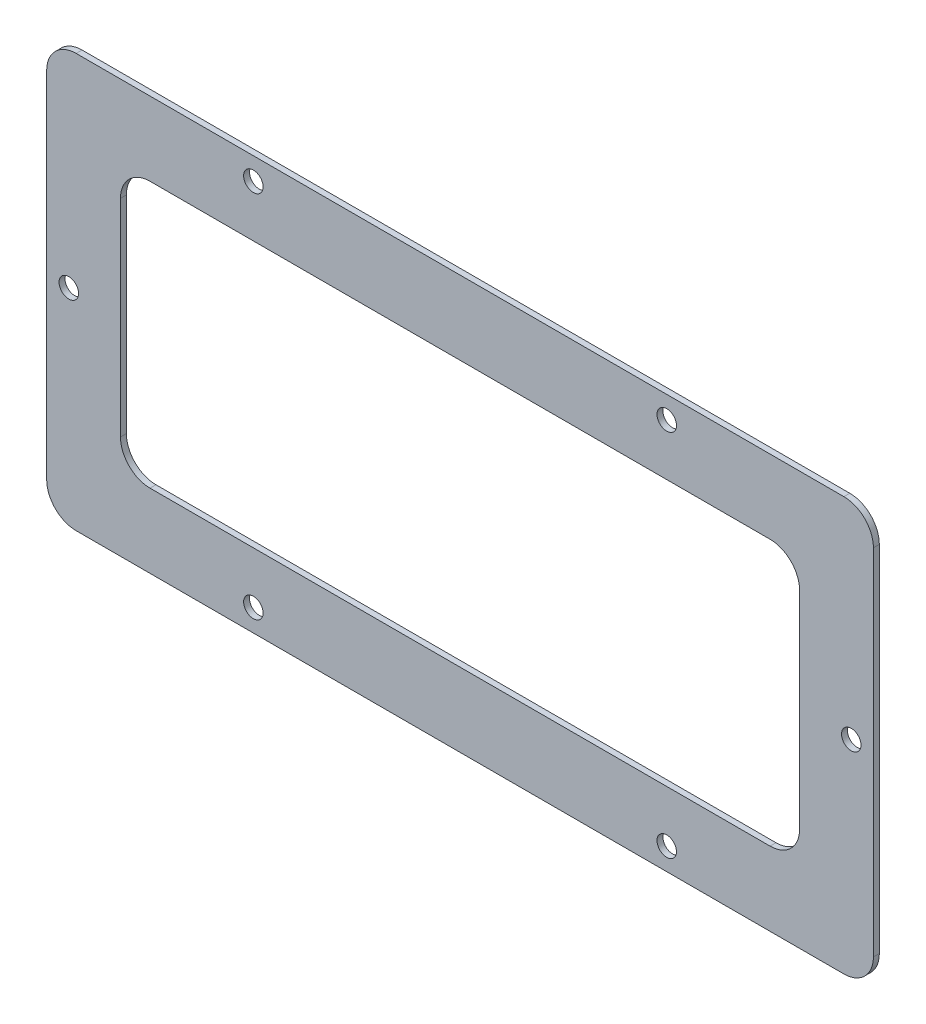
ISO-10303-21;
HEADER;
FILE_DESCRIPTION(('STEP AP214'),'2;1');
FILE_NAME('part.step','',(''),(''),'','','');
FILE_SCHEMA(('AUTOMOTIVE_DESIGN { 1 0 10303 214 1 1 1 1 }'));
ENDSEC;
DATA;
#1=APPLICATION_CONTEXT('core data for automotive mechanical design processes');
#2=APPLICATION_PROTOCOL_DEFINITION('international standard','automotive_design',2000,#1);
#3=PRODUCT_CONTEXT('',#1,'mechanical');
#4=PRODUCT('Part','Part','',(#3));
#5=PRODUCT_RELATED_PRODUCT_CATEGORY('part','',(#4));
#6=PRODUCT_DEFINITION_FORMATION('','',#4);
#7=PRODUCT_DEFINITION_CONTEXT('part definition',#1,'design');
#8=PRODUCT_DEFINITION('design','',#6,#7);
#9=PRODUCT_DEFINITION_SHAPE('','',#8);
#10=(LENGTH_UNIT() NAMED_UNIT(*) SI_UNIT(.MILLI.,.METRE.));
#11=(NAMED_UNIT(*) PLANE_ANGLE_UNIT() SI_UNIT($,.RADIAN.));
#12=(NAMED_UNIT(*) SI_UNIT($,.STERADIAN.) SOLID_ANGLE_UNIT());
#13=UNCERTAINTY_MEASURE_WITH_UNIT(LENGTH_MEASURE(1.E-05),#10,'distance_accuracy_value','');
#14=(GEOMETRIC_REPRESENTATION_CONTEXT(3) GLOBAL_UNCERTAINTY_ASSIGNED_CONTEXT((#13)) GLOBAL_UNIT_ASSIGNED_CONTEXT((#10,
#11,#12)) REPRESENTATION_CONTEXT('',''));
#15=CARTESIAN_POINT('',(0.,0.,0.));
#16=DIRECTION('',(0.,0.,1.));
#17=DIRECTION('',(1.,0.,0.));
#18=AXIS2_PLACEMENT_3D('',#15,#16,#17);
#19=CARTESIAN_POINT('',(140.,-70.,0.));
#20=DIRECTION('',(0.,-1.,0.));
#21=DIRECTION('',(1.,0.,0.));
#22=AXIS2_PLACEMENT_3D('',#19,#20,#21);
#23=PLANE('',#22);
#24=DIRECTION('',(0.,0.,1.));
#25=VECTOR('',#24,1.);
#26=CARTESIAN_POINT('',(-130.,-70.,0.));
#27=LINE('',#26,#25);
#28=CARTESIAN_POINT('',(-130.,-70.,-2.));
#29=VERTEX_POINT('',#28);
#30=CARTESIAN_POINT('',(-130.,-70.,0.));
#31=VERTEX_POINT('',#30);
#32=EDGE_CURVE('E11',#29,#31,#27,.T.);
#33=ORIENTED_EDGE('',*,*,#32,.F.);
#34=DIRECTION('',(1.,0.,0.));
#35=VECTOR('',#34,1.);
#36=CARTESIAN_POINT('',(0.,-70.,-2.));
#37=LINE('',#36,#35);
#38=CARTESIAN_POINT('',(130.,-70.,-2.));
#39=VERTEX_POINT('',#38);
#40=EDGE_CURVE('E129',#29,#39,#37,.T.);
#41=ORIENTED_EDGE('',*,*,#40,.T.);
#42=DIRECTION('',(0.,0.,1.));
#43=VECTOR('',#42,1.);
#44=CARTESIAN_POINT('',(130.,-70.,0.));
#45=LINE('',#44,#43);
#46=CARTESIAN_POINT('',(130.,-70.,0.));
#47=VERTEX_POINT('',#46);
#48=EDGE_CURVE('E47',#39,#47,#45,.T.);
#49=ORIENTED_EDGE('',*,*,#48,.T.);
#50=DIRECTION('',(1.,0.,0.));
#51=VECTOR('',#50,1.);
#52=CARTESIAN_POINT('',(140.,-70.,0.));
#53=LINE('',#52,#51);
#54=EDGE_CURVE('E197',#31,#47,#53,.T.);
#55=ORIENTED_EDGE('',*,*,#54,.F.);
#56=EDGE_LOOP('',(#33,#41,#49,#55));
#57=FACE_BOUND('',#56,.T.);
#58=ADVANCED_FACE('F37',(#57),#23,.T.);
#59=CARTESIAN_POINT('',(130.,-60.,0.));
#60=DIRECTION('',(0.,0.,1.));
#61=DIRECTION('',(1.,0.,0.));
#62=AXIS2_PLACEMENT_3D('',#59,#60,#61);
#63=CYLINDRICAL_SURFACE('',#62,10.);
#64=ORIENTED_EDGE('',*,*,#48,.F.);
#65=CARTESIAN_POINT('',(130.,-60.,-2.));
#66=DIRECTION('',(0.,0.,1.));
#67=DIRECTION('',(1.,0.,0.));
#68=AXIS2_PLACEMENT_3D('',#65,#66,#67);
#69=CIRCLE('',#68,10.);
#70=CARTESIAN_POINT('',(140.,-60.,-2.));
#71=VERTEX_POINT('',#70);
#72=EDGE_CURVE('E153',#39,#71,#69,.T.);
#73=ORIENTED_EDGE('',*,*,#72,.T.);
#74=DIRECTION('',(0.,0.,1.));
#75=VECTOR('',#74,1.);
#76=CARTESIAN_POINT('',(140.,-60.,0.));
#77=LINE('',#76,#75);
#78=CARTESIAN_POINT('',(140.,-60.,0.));
#79=VERTEX_POINT('',#78);
#80=EDGE_CURVE('E190',#71,#79,#77,.T.);
#81=ORIENTED_EDGE('',*,*,#80,.T.);
#82=CARTESIAN_POINT('',(130.,-60.,0.));
#83=DIRECTION('',(0.,0.,1.));
#84=DIRECTION('',(1.,0.,0.));
#85=AXIS2_PLACEMENT_3D('',#82,#83,#84);
#86=CIRCLE('',#85,10.);
#87=EDGE_CURVE('E206',#47,#79,#86,.T.);
#88=ORIENTED_EDGE('',*,*,#87,.F.);
#89=EDGE_LOOP('',(#64,#73,#81,#88));
#90=FACE_BOUND('',#89,.T.);
#91=ADVANCED_FACE('F209',(#90),#63,.T.);
#92=CARTESIAN_POINT('',(140.,-70.,0.));
#93=DIRECTION('',(1.,0.,0.));
#94=DIRECTION('',(0.,1.,0.));
#95=AXIS2_PLACEMENT_3D('',#92,#93,#94);
#96=PLANE('',#95);
#97=ORIENTED_EDGE('',*,*,#80,.F.);
#98=DIRECTION('',(0.,1.,0.));
#99=VECTOR('',#98,1.);
#100=CARTESIAN_POINT('',(140.,0.,-2.));
#101=LINE('',#100,#99);
#102=CARTESIAN_POINT('',(140.,60.,-2.));
#103=VERTEX_POINT('',#102);
#104=EDGE_CURVE('E150',#71,#103,#101,.T.);
#105=ORIENTED_EDGE('',*,*,#104,.T.);
#106=DIRECTION('',(0.,0.,1.));
#107=VECTOR('',#106,1.);
#108=CARTESIAN_POINT('',(140.,60.,0.));
#109=LINE('',#108,#107);
#110=CARTESIAN_POINT('',(140.,60.,0.));
#111=VERTEX_POINT('',#110);
#112=EDGE_CURVE('E187',#103,#111,#109,.T.);
#113=ORIENTED_EDGE('',*,*,#112,.T.);
#114=DIRECTION('',(0.,1.,0.));
#115=VECTOR('',#114,1.);
#116=CARTESIAN_POINT('',(140.,-70.,0.));
#117=LINE('',#116,#115);
#118=EDGE_CURVE('E210',#79,#111,#117,.T.);
#119=ORIENTED_EDGE('',*,*,#118,.F.);
#120=EDGE_LOOP('',(#97,#105,#113,#119));
#121=FACE_BOUND('',#120,.T.);
#122=ADVANCED_FACE('F394',(#121),#96,.T.);
#123=CARTESIAN_POINT('',(130.,60.,0.));
#124=DIRECTION('',(0.,0.,1.));
#125=DIRECTION('',(1.,0.,0.));
#126=AXIS2_PLACEMENT_3D('',#123,#124,#125);
#127=CYLINDRICAL_SURFACE('',#126,10.);
#128=ORIENTED_EDGE('',*,*,#112,.F.);
#129=CARTESIAN_POINT('',(130.,60.,-2.));
#130=DIRECTION('',(0.,0.,1.));
#131=DIRECTION('',(1.,0.,0.));
#132=AXIS2_PLACEMENT_3D('',#129,#130,#131);
#133=CIRCLE('',#132,10.);
#134=CARTESIAN_POINT('',(130.,70.,-2.));
#135=VERTEX_POINT('',#134);
#136=EDGE_CURVE('E147',#103,#135,#133,.T.);
#137=ORIENTED_EDGE('',*,*,#136,.T.);
#138=DIRECTION('',(0.,0.,1.));
#139=VECTOR('',#138,1.);
#140=CARTESIAN_POINT('',(130.,70.,0.));
#141=LINE('',#140,#139);
#142=CARTESIAN_POINT('',(130.,70.,0.));
#143=VERTEX_POINT('',#142);
#144=EDGE_CURVE('E184',#135,#143,#141,.T.);
#145=ORIENTED_EDGE('',*,*,#144,.T.);
#146=CARTESIAN_POINT('',(130.,60.,0.));
#147=DIRECTION('',(0.,0.,1.));
#148=DIRECTION('',(1.,0.,0.));
#149=AXIS2_PLACEMENT_3D('',#146,#147,#148);
#150=CIRCLE('',#149,10.);
#151=EDGE_CURVE('E212',#111,#143,#150,.T.);
#152=ORIENTED_EDGE('',*,*,#151,.F.);
#153=EDGE_LOOP('',(#128,#137,#145,#152));
#154=FACE_BOUND('',#153,.T.);
#155=ADVANCED_FACE('F291',(#154),#127,.T.);
#156=CARTESIAN_POINT('',(140.,70.,0.));
#157=DIRECTION('',(0.,1.,0.));
#158=DIRECTION('',(-1.,0.,0.));
#159=AXIS2_PLACEMENT_3D('',#156,#157,#158);
#160=PLANE('',#159);
#161=ORIENTED_EDGE('',*,*,#144,.F.);
#162=DIRECTION('',(1.,0.,0.));
#163=VECTOR('',#162,1.);
#164=CARTESIAN_POINT('',(0.,70.,-2.));
#165=LINE('',#164,#163);
#166=CARTESIAN_POINT('',(-130.,70.,-2.));
#167=VERTEX_POINT('',#166);
#168=EDGE_CURVE('E144',#135,#167,#165,.F.);
#169=ORIENTED_EDGE('',*,*,#168,.T.);
#170=DIRECTION('',(0.,0.,1.));
#171=VECTOR('',#170,1.);
#172=CARTESIAN_POINT('',(-130.,70.,0.));
#173=LINE('',#172,#171);
#174=CARTESIAN_POINT('',(-130.,70.,0.));
#175=VERTEX_POINT('',#174);
#176=EDGE_CURVE('E182',#167,#175,#173,.T.);
#177=ORIENTED_EDGE('',*,*,#176,.T.);
#178=DIRECTION('',(-1.,0.,0.));
#179=VECTOR('',#178,1.);
#180=CARTESIAN_POINT('',(140.,70.,0.));
#181=LINE('',#180,#179);
#182=EDGE_CURVE('E218',#143,#175,#181,.T.);
#183=ORIENTED_EDGE('',*,*,#182,.F.);
#184=EDGE_LOOP('',(#161,#169,#177,#183));
#185=FACE_BOUND('',#184,.T.);
#186=ADVANCED_FACE('F296',(#185),#160,.T.);
#187=CARTESIAN_POINT('',(-130.,60.,0.));
#188=DIRECTION('',(0.,0.,1.));
#189=DIRECTION('',(1.,0.,0.));
#190=AXIS2_PLACEMENT_3D('',#187,#188,#189);
#191=CYLINDRICAL_SURFACE('',#190,10.);
#192=ORIENTED_EDGE('',*,*,#176,.F.);
#193=CARTESIAN_POINT('',(-130.,60.,-2.));
#194=DIRECTION('',(0.,0.,1.));
#195=DIRECTION('',(1.,0.,0.));
#196=AXIS2_PLACEMENT_3D('',#193,#194,#195);
#197=CIRCLE('',#196,10.);
#198=CARTESIAN_POINT('',(-140.,60.,-2.));
#199=VERTEX_POINT('',#198);
#200=EDGE_CURVE('E141',#167,#199,#197,.T.);
#201=ORIENTED_EDGE('',*,*,#200,.T.);
#202=DIRECTION('',(0.,0.,1.));
#203=VECTOR('',#202,1.);
#204=CARTESIAN_POINT('',(-140.,60.,0.));
#205=LINE('',#204,#203);
#206=CARTESIAN_POINT('',(-140.,60.,0.));
#207=VERTEX_POINT('',#206);
#208=EDGE_CURVE('E55',#199,#207,#205,.T.);
#209=ORIENTED_EDGE('',*,*,#208,.T.);
#210=CARTESIAN_POINT('',(-130.,60.,0.));
#211=DIRECTION('',(0.,0.,1.));
#212=DIRECTION('',(1.,0.,0.));
#213=AXIS2_PLACEMENT_3D('',#210,#211,#212);
#214=CIRCLE('',#213,10.);
#215=EDGE_CURVE('E180',#175,#207,#214,.T.);
#216=ORIENTED_EDGE('',*,*,#215,.F.);
#217=EDGE_LOOP('',(#192,#201,#209,#216));
#218=FACE_BOUND('',#217,.T.);
#219=ADVANCED_FACE('F297',(#218),#191,.T.);
#220=CARTESIAN_POINT('',(-140.,-70.,0.));
#221=DIRECTION('',(-1.,0.,0.));
#222=DIRECTION('',(0.,-1.,0.));
#223=AXIS2_PLACEMENT_3D('',#220,#221,#222);
#224=PLANE('',#223);
#225=ORIENTED_EDGE('',*,*,#208,.F.);
#226=DIRECTION('',(0.,1.,0.));
#227=VECTOR('',#226,1.);
#228=CARTESIAN_POINT('',(-140.,0.,-2.));
#229=LINE('',#228,#227);
#230=CARTESIAN_POINT('',(-140.,-60.,-2.));
#231=VERTEX_POINT('',#230);
#232=EDGE_CURVE('E127',#199,#231,#229,.F.);
#233=ORIENTED_EDGE('',*,*,#232,.T.);
#234=DIRECTION('',(0.,0.,1.));
#235=VECTOR('',#234,1.);
#236=CARTESIAN_POINT('',(-140.,-60.,0.));
#237=LINE('',#236,#235);
#238=CARTESIAN_POINT('',(-140.,-60.,0.));
#239=VERTEX_POINT('',#238);
#240=EDGE_CURVE('E41',#231,#239,#237,.T.);
#241=ORIENTED_EDGE('',*,*,#240,.T.);
#242=DIRECTION('',(0.,-1.,0.));
#243=VECTOR('',#242,1.);
#244=CARTESIAN_POINT('',(-140.,-70.,0.));
#245=LINE('',#244,#243);
#246=EDGE_CURVE('E298',#207,#239,#245,.T.);
#247=ORIENTED_EDGE('',*,*,#246,.F.);
#248=EDGE_LOOP('',(#225,#233,#241,#247));
#249=FACE_BOUND('',#248,.T.);
#250=ADVANCED_FACE('F131',(#249),#224,.T.);
#251=CARTESIAN_POINT('',(-115.,-45.,0.));
#252=DIRECTION('',(0.,-1.,0.));
#253=DIRECTION('',(1.,0.,0.));
#254=AXIS2_PLACEMENT_3D('',#251,#252,#253);
#255=PLANE('',#254);
#256=DIRECTION('',(0.,0.,1.));
#257=VECTOR('',#256,1.);
#258=CARTESIAN_POINT('',(105.,-45.,0.));
#259=LINE('',#258,#257);
#260=CARTESIAN_POINT('',(105.,-45.,-2.));
#261=VERTEX_POINT('',#260);
#262=CARTESIAN_POINT('',(105.,-45.,0.));
#263=VERTEX_POINT('',#262);
#264=EDGE_CURVE('E122',#261,#263,#259,.T.);
#265=ORIENTED_EDGE('',*,*,#264,.F.);
#266=DIRECTION('',(1.,0.,0.));
#267=VECTOR('',#266,1.);
#268=CARTESIAN_POINT('',(0.,-45.,-2.));
#269=LINE('',#268,#267);
#270=CARTESIAN_POINT('',(-105.,-45.,-2.));
#271=VERTEX_POINT('',#270);
#272=EDGE_CURVE('E254',#271,#261,#269,.T.);
#273=ORIENTED_EDGE('',*,*,#272,.F.);
#274=DIRECTION('',(0.,0.,1.));
#275=VECTOR('',#274,1.);
#276=CARTESIAN_POINT('',(-105.,-45.,0.));
#277=LINE('',#276,#275);
#278=CARTESIAN_POINT('',(-105.,-45.,0.));
#279=VERTEX_POINT('',#278);
#280=EDGE_CURVE('E173',#271,#279,#277,.T.);
#281=ORIENTED_EDGE('',*,*,#280,.T.);
#282=DIRECTION('',(1.,0.,0.));
#283=VECTOR('',#282,1.);
#284=CARTESIAN_POINT('',(-115.,-45.,0.));
#285=LINE('',#284,#283);
#286=EDGE_CURVE('E314',#279,#263,#285,.T.);
#287=ORIENTED_EDGE('',*,*,#286,.T.);
#288=EDGE_LOOP('',(#265,#273,#281,#287));
#289=FACE_BOUND('',#288,.T.);
#290=ADVANCED_FACE('F379',(#289),#255,.F.);
#291=CARTESIAN_POINT('',(-105.,-35.,0.));
#292=DIRECTION('',(0.,0.,1.));
#293=DIRECTION('',(1.,0.,0.));
#294=AXIS2_PLACEMENT_3D('',#291,#292,#293);
#295=CYLINDRICAL_SURFACE('',#294,10.);
#296=ORIENTED_EDGE('',*,*,#280,.F.);
#297=CARTESIAN_POINT('',(-105.,-35.,-2.));
#298=DIRECTION('',(0.,0.,1.));
#299=DIRECTION('',(1.,0.,0.));
#300=AXIS2_PLACEMENT_3D('',#297,#298,#299);
#301=CIRCLE('',#300,10.);
#302=CARTESIAN_POINT('',(-115.,-35.,-2.));
#303=VERTEX_POINT('',#302);
#304=EDGE_CURVE('E252',#271,#303,#301,.F.);
#305=ORIENTED_EDGE('',*,*,#304,.T.);
#306=DIRECTION('',(0.,0.,1.));
#307=VECTOR('',#306,1.);
#308=CARTESIAN_POINT('',(-115.,-35.,0.));
#309=LINE('',#308,#307);
#310=CARTESIAN_POINT('',(-115.,-35.,0.));
#311=VERTEX_POINT('',#310);
#312=EDGE_CURVE('E170',#303,#311,#309,.T.);
#313=ORIENTED_EDGE('',*,*,#312,.T.);
#314=CARTESIAN_POINT('',(-105.,-35.,0.));
#315=DIRECTION('',(0.,0.,1.));
#316=DIRECTION('',(1.,0.,0.));
#317=AXIS2_PLACEMENT_3D('',#314,#315,#316);
#318=CIRCLE('',#317,10.);
#319=EDGE_CURVE('E311',#279,#311,#318,.F.);
#320=ORIENTED_EDGE('',*,*,#319,.F.);
#321=EDGE_LOOP('',(#296,#305,#313,#320));
#322=FACE_BOUND('',#321,.T.);
#323=ADVANCED_FACE('F377',(#322),#295,.F.);
#324=CARTESIAN_POINT('',(-115.,-45.,0.));
#325=DIRECTION('',(-1.,0.,0.));
#326=DIRECTION('',(0.,-1.,0.));
#327=AXIS2_PLACEMENT_3D('',#324,#325,#326);
#328=PLANE('',#327);
#329=ORIENTED_EDGE('',*,*,#312,.F.);
#330=DIRECTION('',(0.,1.,0.));
#331=VECTOR('',#330,1.);
#332=CARTESIAN_POINT('',(-115.,0.,-2.));
#333=LINE('',#332,#331);
#334=CARTESIAN_POINT('',(-115.,35.,-2.));
#335=VERTEX_POINT('',#334);
#336=EDGE_CURVE('E249',#335,#303,#333,.F.);
#337=ORIENTED_EDGE('',*,*,#336,.F.);
#338=DIRECTION('',(0.,0.,1.));
#339=VECTOR('',#338,1.);
#340=CARTESIAN_POINT('',(-115.,35.,0.));
#341=LINE('',#340,#339);
#342=CARTESIAN_POINT('',(-115.,35.,0.));
#343=VERTEX_POINT('',#342);
#344=EDGE_CURVE('E167',#335,#343,#341,.T.);
#345=ORIENTED_EDGE('',*,*,#344,.T.);
#346=DIRECTION('',(0.,-1.,0.));
#347=VECTOR('',#346,1.);
#348=CARTESIAN_POINT('',(-115.,-45.,0.));
#349=LINE('',#348,#347);
#350=EDGE_CURVE('E308',#343,#311,#349,.T.);
#351=ORIENTED_EDGE('',*,*,#350,.T.);
#352=EDGE_LOOP('',(#329,#337,#345,#351));
#353=FACE_BOUND('',#352,.T.);
#354=ADVANCED_FACE('F374',(#353),#328,.F.);
#355=CARTESIAN_POINT('',(-105.,35.,0.));
#356=DIRECTION('',(0.,0.,1.));
#357=DIRECTION('',(1.,0.,0.));
#358=AXIS2_PLACEMENT_3D('',#355,#356,#357);
#359=CYLINDRICAL_SURFACE('',#358,10.);
#360=ORIENTED_EDGE('',*,*,#344,.F.);
#361=CARTESIAN_POINT('',(-105.,35.,-2.));
#362=DIRECTION('',(0.,0.,1.));
#363=DIRECTION('',(1.,0.,0.));
#364=AXIS2_PLACEMENT_3D('',#361,#362,#363);
#365=CIRCLE('',#364,10.);
#366=CARTESIAN_POINT('',(-105.,45.,-2.));
#367=VERTEX_POINT('',#366);
#368=EDGE_CURVE('E246',#335,#367,#365,.F.);
#369=ORIENTED_EDGE('',*,*,#368,.T.);
#370=DIRECTION('',(0.,0.,1.));
#371=VECTOR('',#370,1.);
#372=CARTESIAN_POINT('',(-105.,45.,0.));
#373=LINE('',#372,#371);
#374=CARTESIAN_POINT('',(-105.,45.,0.));
#375=VERTEX_POINT('',#374);
#376=EDGE_CURVE('E164',#367,#375,#373,.T.);
#377=ORIENTED_EDGE('',*,*,#376,.T.);
#378=CARTESIAN_POINT('',(-105.,35.,0.));
#379=DIRECTION('',(0.,0.,1.));
#380=DIRECTION('',(1.,0.,0.));
#381=AXIS2_PLACEMENT_3D('',#378,#379,#380);
#382=CIRCLE('',#381,10.);
#383=EDGE_CURVE('E305',#343,#375,#382,.F.);
#384=ORIENTED_EDGE('',*,*,#383,.F.);
#385=EDGE_LOOP('',(#360,#369,#377,#384));
#386=FACE_BOUND('',#385,.T.);
#387=ADVANCED_FACE('F366',(#386),#359,.F.);
#388=CARTESIAN_POINT('',(-115.,45.,0.));
#389=DIRECTION('',(0.,1.,0.));
#390=DIRECTION('',(-1.,0.,0.));
#391=AXIS2_PLACEMENT_3D('',#388,#389,#390);
#392=PLANE('',#391);
#393=ORIENTED_EDGE('',*,*,#376,.F.);
#394=DIRECTION('',(1.,0.,0.));
#395=VECTOR('',#394,1.);
#396=CARTESIAN_POINT('',(0.,45.,-2.));
#397=LINE('',#396,#395);
#398=CARTESIAN_POINT('',(105.,45.,-2.));
#399=VERTEX_POINT('',#398);
#400=EDGE_CURVE('E135',#399,#367,#397,.F.);
#401=ORIENTED_EDGE('',*,*,#400,.F.);
#402=DIRECTION('',(0.,0.,1.));
#403=VECTOR('',#402,1.);
#404=CARTESIAN_POINT('',(105.,45.,0.));
#405=LINE('',#404,#403);
#406=CARTESIAN_POINT('',(105.,45.,0.));
#407=VERTEX_POINT('',#406);
#408=EDGE_CURVE('E160',#399,#407,#405,.T.);
#409=ORIENTED_EDGE('',*,*,#408,.T.);
#410=DIRECTION('',(-1.,0.,0.));
#411=VECTOR('',#410,1.);
#412=CARTESIAN_POINT('',(-115.,45.,0.));
#413=LINE('',#412,#411);
#414=EDGE_CURVE('E300',#407,#375,#413,.T.);
#415=ORIENTED_EDGE('',*,*,#414,.T.);
#416=EDGE_LOOP('',(#393,#401,#409,#415));
#417=FACE_BOUND('',#416,.T.);
#418=ADVANCED_FACE('F371',(#417),#392,.F.);
#419=CARTESIAN_POINT('',(105.,35.,0.));
#420=DIRECTION('',(0.,0.,1.));
#421=DIRECTION('',(1.,0.,0.));
#422=AXIS2_PLACEMENT_3D('',#419,#420,#421);
#423=CYLINDRICAL_SURFACE('',#422,10.);
#424=ORIENTED_EDGE('',*,*,#408,.F.);
#425=CARTESIAN_POINT('',(105.,35.,-2.));
#426=DIRECTION('',(0.,0.,1.));
#427=DIRECTION('',(1.,0.,0.));
#428=AXIS2_PLACEMENT_3D('',#425,#426,#427);
#429=CIRCLE('',#428,10.);
#430=CARTESIAN_POINT('',(115.,35.,-2.));
#431=VERTEX_POINT('',#430);
#432=EDGE_CURVE('E132',#399,#431,#429,.F.);
#433=ORIENTED_EDGE('',*,*,#432,.T.);
#434=DIRECTION('',(0.,0.,1.));
#435=VECTOR('',#434,1.);
#436=CARTESIAN_POINT('',(115.,35.,0.));
#437=LINE('',#436,#435);
#438=CARTESIAN_POINT('',(115.,35.,0.));
#439=VERTEX_POINT('',#438);
#440=EDGE_CURVE('E157',#431,#439,#437,.T.);
#441=ORIENTED_EDGE('',*,*,#440,.T.);
#442=CARTESIAN_POINT('',(105.,35.,0.));
#443=DIRECTION('',(0.,0.,1.));
#444=DIRECTION('',(1.,0.,0.));
#445=AXIS2_PLACEMENT_3D('',#442,#443,#444);
#446=CIRCLE('',#445,10.);
#447=EDGE_CURVE('E279',#407,#439,#446,.F.);
#448=ORIENTED_EDGE('',*,*,#447,.F.);
#449=EDGE_LOOP('',(#424,#433,#441,#448));
#450=FACE_BOUND('',#449,.T.);
#451=ADVANCED_FACE('F277',(#450),#423,.F.);
#452=CARTESIAN_POINT('',(115.,-45.,0.));
#453=DIRECTION('',(1.,0.,0.));
#454=DIRECTION('',(0.,1.,0.));
#455=AXIS2_PLACEMENT_3D('',#452,#453,#454);
#456=PLANE('',#455);
#457=ORIENTED_EDGE('',*,*,#440,.F.);
#458=DIRECTION('',(0.,1.,0.));
#459=VECTOR('',#458,1.);
#460=CARTESIAN_POINT('',(115.,0.,-2.));
#461=LINE('',#460,#459);
#462=CARTESIAN_POINT('',(115.,-35.,-2.));
#463=VERTEX_POINT('',#462);
#464=EDGE_CURVE('E241',#463,#431,#461,.T.);
#465=ORIENTED_EDGE('',*,*,#464,.F.);
#466=DIRECTION('',(0.,0.,1.));
#467=VECTOR('',#466,1.);
#468=CARTESIAN_POINT('',(115.,-35.,0.));
#469=LINE('',#468,#467);
#470=CARTESIAN_POINT('',(115.,-35.,0.));
#471=VERTEX_POINT('',#470);
#472=EDGE_CURVE('E161',#463,#471,#469,.T.);
#473=ORIENTED_EDGE('',*,*,#472,.T.);
#474=DIRECTION('',(0.,1.,0.));
#475=VECTOR('',#474,1.);
#476=CARTESIAN_POINT('',(115.,-45.,0.));
#477=LINE('',#476,#475);
#478=EDGE_CURVE('E273',#471,#439,#477,.T.);
#479=ORIENTED_EDGE('',*,*,#478,.T.);
#480=EDGE_LOOP('',(#457,#465,#473,#479));
#481=FACE_BOUND('',#480,.T.);
#482=ADVANCED_FACE('F269',(#481),#456,.F.);
#483=CARTESIAN_POINT('',(70.,62.5,0.));
#484=DIRECTION('',(0.,0.,1.));
#485=DIRECTION('',(1.,0.,0.));
#486=AXIS2_PLACEMENT_3D('',#483,#484,#485);
#487=CYLINDRICAL_SURFACE('',#486,3.3);
#488=CARTESIAN_POINT('',(70.,62.5,0.));
#489=DIRECTION('',(0.,0.,1.));
#490=DIRECTION('',(1.,0.,0.));
#491=AXIS2_PLACEMENT_3D('',#488,#489,#490);
#492=CIRCLE('',#491,3.3);
#493=CARTESIAN_POINT('',(73.3,62.5,0.));
#494=VERTEX_POINT('',#493);
#495=EDGE_CURVE('E143',#494,#494,#492,.T.);
#496=ORIENTED_EDGE('',*,*,#495,.T.);
#497=EDGE_LOOP('',(#496));
#498=FACE_BOUND('',#497,.T.);
#499=CARTESIAN_POINT('',(70.,62.5,-2.));
#500=DIRECTION('',(0.,0.,1.));
#501=DIRECTION('',(1.,0.,0.));
#502=AXIS2_PLACEMENT_3D('',#499,#500,#501);
#503=CIRCLE('',#502,3.3);
#504=CARTESIAN_POINT('',(73.3,62.5,-2.));
#505=VERTEX_POINT('',#504);
#506=EDGE_CURVE('E223',#505,#505,#503,.T.);
#507=ORIENTED_EDGE('',*,*,#506,.F.);
#508=EDGE_LOOP('',(#507));
#509=FACE_BOUND('',#508,.T.);
#510=ADVANCED_FACE('F338',(#498,#509),#487,.F.);
#511=CARTESIAN_POINT('',(-70.,62.5,0.));
#512=DIRECTION('',(0.,0.,1.));
#513=DIRECTION('',(1.,0.,0.));
#514=AXIS2_PLACEMENT_3D('',#511,#512,#513);
#515=CYLINDRICAL_SURFACE('',#514,3.3);
#516=CARTESIAN_POINT('',(-70.,62.5,0.));
#517=DIRECTION('',(0.,0.,1.));
#518=DIRECTION('',(1.,0.,0.));
#519=AXIS2_PLACEMENT_3D('',#516,#517,#518);
#520=CIRCLE('',#519,3.3);
#521=CARTESIAN_POINT('',(-66.7,62.5,0.));
#522=VERTEX_POINT('',#521);
#523=EDGE_CURVE('E332',#522,#522,#520,.T.);
#524=ORIENTED_EDGE('',*,*,#523,.T.);
#525=EDGE_LOOP('',(#524));
#526=FACE_BOUND('',#525,.T.);
#527=CARTESIAN_POINT('',(-70.,62.5,-2.));
#528=DIRECTION('',(0.,0.,1.));
#529=DIRECTION('',(1.,0.,0.));
#530=AXIS2_PLACEMENT_3D('',#527,#528,#529);
#531=CIRCLE('',#530,3.3);
#532=CARTESIAN_POINT('',(-66.7,62.5,-2.));
#533=VERTEX_POINT('',#532);
#534=EDGE_CURVE('E226',#533,#533,#531,.T.);
#535=ORIENTED_EDGE('',*,*,#534,.F.);
#536=EDGE_LOOP('',(#535));
#537=FACE_BOUND('',#536,.T.);
#538=ADVANCED_FACE('F458',(#526,#537),#515,.F.);
#539=CARTESIAN_POINT('',(-132.5,0.,0.));
#540=DIRECTION('',(0.,0.,1.));
#541=DIRECTION('',(1.,0.,0.));
#542=AXIS2_PLACEMENT_3D('',#539,#540,#541);
#543=CYLINDRICAL_SURFACE('',#542,3.3);
#544=CARTESIAN_POINT('',(-132.5,0.,0.));
#545=DIRECTION('',(0.,0.,1.));
#546=DIRECTION('',(1.,0.,0.));
#547=AXIS2_PLACEMENT_3D('',#544,#545,#546);
#548=CIRCLE('',#547,3.3);
#549=CARTESIAN_POINT('',(-129.2,0.,0.));
#550=VERTEX_POINT('',#549);
#551=EDGE_CURVE('E329',#550,#550,#548,.T.);
#552=ORIENTED_EDGE('',*,*,#551,.T.);
#553=EDGE_LOOP('',(#552));
#554=FACE_BOUND('',#553,.T.);
#555=CARTESIAN_POINT('',(-132.5,0.,-2.));
#556=DIRECTION('',(0.,0.,1.));
#557=DIRECTION('',(1.,0.,0.));
#558=AXIS2_PLACEMENT_3D('',#555,#556,#557);
#559=CIRCLE('',#558,3.3);
#560=CARTESIAN_POINT('',(-129.2,0.,-2.));
#561=VERTEX_POINT('',#560);
#562=EDGE_CURVE('E229',#561,#561,#559,.T.);
#563=ORIENTED_EDGE('',*,*,#562,.F.);
#564=EDGE_LOOP('',(#563));
#565=FACE_BOUND('',#564,.T.);
#566=ADVANCED_FACE('F465',(#554,#565),#543,.F.);
#567=CARTESIAN_POINT('',(-70.,-62.5,0.));
#568=DIRECTION('',(0.,0.,1.));
#569=DIRECTION('',(1.,0.,0.));
#570=AXIS2_PLACEMENT_3D('',#567,#568,#569);
#571=CYLINDRICAL_SURFACE('',#570,3.3);
#572=CARTESIAN_POINT('',(-70.,-62.5,0.));
#573=DIRECTION('',(0.,0.,1.));
#574=DIRECTION('',(1.,0.,0.));
#575=AXIS2_PLACEMENT_3D('',#572,#573,#574);
#576=CIRCLE('',#575,3.3);
#577=CARTESIAN_POINT('',(-66.7,-62.5,0.));
#578=VERTEX_POINT('',#577);
#579=EDGE_CURVE('E326',#578,#578,#576,.T.);
#580=ORIENTED_EDGE('',*,*,#579,.T.);
#581=EDGE_LOOP('',(#580));
#582=FACE_BOUND('',#581,.T.);
#583=CARTESIAN_POINT('',(-70.,-62.5,-2.));
#584=DIRECTION('',(0.,0.,1.));
#585=DIRECTION('',(1.,0.,0.));
#586=AXIS2_PLACEMENT_3D('',#583,#584,#585);
#587=CIRCLE('',#586,3.3);
#588=CARTESIAN_POINT('',(-66.7,-62.5,-2.));
#589=VERTEX_POINT('',#588);
#590=EDGE_CURVE('E232',#589,#589,#587,.T.);
#591=ORIENTED_EDGE('',*,*,#590,.F.);
#592=EDGE_LOOP('',(#591));
#593=FACE_BOUND('',#592,.T.);
#594=ADVANCED_FACE('F417',(#582,#593),#571,.F.);
#595=CARTESIAN_POINT('',(70.,-62.5,0.));
#596=DIRECTION('',(0.,0.,1.));
#597=DIRECTION('',(1.,0.,0.));
#598=AXIS2_PLACEMENT_3D('',#595,#596,#597);
#599=CYLINDRICAL_SURFACE('',#598,3.3);
#600=CARTESIAN_POINT('',(70.,-62.5,0.));
#601=DIRECTION('',(0.,0.,1.));
#602=DIRECTION('',(1.,0.,0.));
#603=AXIS2_PLACEMENT_3D('',#600,#601,#602);
#604=CIRCLE('',#603,3.3);
#605=CARTESIAN_POINT('',(73.3,-62.5,0.));
#606=VERTEX_POINT('',#605);
#607=EDGE_CURVE('E323',#606,#606,#604,.T.);
#608=ORIENTED_EDGE('',*,*,#607,.T.);
#609=EDGE_LOOP('',(#608));
#610=FACE_BOUND('',#609,.T.);
#611=CARTESIAN_POINT('',(70.,-62.5,-2.));
#612=DIRECTION('',(0.,0.,1.));
#613=DIRECTION('',(1.,0.,0.));
#614=AXIS2_PLACEMENT_3D('',#611,#612,#613);
#615=CIRCLE('',#614,3.3);
#616=CARTESIAN_POINT('',(73.3,-62.5,-2.));
#617=VERTEX_POINT('',#616);
#618=EDGE_CURVE('E235',#617,#617,#615,.T.);
#619=ORIENTED_EDGE('',*,*,#618,.F.);
#620=EDGE_LOOP('',(#619));
#621=FACE_BOUND('',#620,.T.);
#622=ADVANCED_FACE('F411',(#610,#621),#599,.F.);
#623=CARTESIAN_POINT('',(132.5,0.,0.));
#624=DIRECTION('',(0.,0.,1.));
#625=DIRECTION('',(1.,0.,0.));
#626=AXIS2_PLACEMENT_3D('',#623,#624,#625);
#627=CYLINDRICAL_SURFACE('',#626,3.3);
#628=CARTESIAN_POINT('',(132.5,0.,0.));
#629=DIRECTION('',(0.,0.,1.));
#630=DIRECTION('',(1.,0.,0.));
#631=AXIS2_PLACEMENT_3D('',#628,#629,#630);
#632=CIRCLE('',#631,3.3);
#633=CARTESIAN_POINT('',(135.8,0.,0.));
#634=VERTEX_POINT('',#633);
#635=EDGE_CURVE('E320',#634,#634,#632,.T.);
#636=ORIENTED_EDGE('',*,*,#635,.T.);
#637=EDGE_LOOP('',(#636));
#638=FACE_BOUND('',#637,.T.);
#639=CARTESIAN_POINT('',(132.5,0.,-2.));
#640=DIRECTION('',(0.,0.,1.));
#641=DIRECTION('',(1.,0.,0.));
#642=AXIS2_PLACEMENT_3D('',#639,#640,#641);
#643=CIRCLE('',#642,3.3);
#644=CARTESIAN_POINT('',(135.8,0.,-2.));
#645=VERTEX_POINT('',#644);
#646=EDGE_CURVE('E238',#645,#645,#643,.T.);
#647=ORIENTED_EDGE('',*,*,#646,.F.);
#648=EDGE_LOOP('',(#647));
#649=FACE_BOUND('',#648,.T.);
#650=ADVANCED_FACE('F406',(#638,#649),#627,.F.);
#651=CARTESIAN_POINT('',(105.,-35.,0.));
#652=DIRECTION('',(0.,0.,1.));
#653=DIRECTION('',(1.,0.,0.));
#654=AXIS2_PLACEMENT_3D('',#651,#652,#653);
#655=CYLINDRICAL_SURFACE('',#654,10.);
#656=CARTESIAN_POINT('',(105.,-35.,-2.));
#657=DIRECTION('',(0.,0.,1.));
#658=DIRECTION('',(1.,0.,0.));
#659=AXIS2_PLACEMENT_3D('',#656,#657,#658);
#660=CIRCLE('',#659,10.);
#661=EDGE_CURVE('E139',#463,#261,#660,.F.);
#662=ORIENTED_EDGE('',*,*,#661,.T.);
#663=ORIENTED_EDGE('',*,*,#264,.T.);
#664=CARTESIAN_POINT('',(105.,-35.,0.));
#665=DIRECTION('',(0.,0.,1.));
#666=DIRECTION('',(1.,0.,0.));
#667=AXIS2_PLACEMENT_3D('',#664,#665,#666);
#668=CIRCLE('',#667,10.);
#669=EDGE_CURVE('E317',#471,#263,#668,.F.);
#670=ORIENTED_EDGE('',*,*,#669,.F.);
#671=ORIENTED_EDGE('',*,*,#472,.F.);
#672=EDGE_LOOP('',(#662,#663,#670,#671));
#673=FACE_BOUND('',#672,.T.);
#674=ADVANCED_FACE('F262',(#673),#655,.F.);
#675=CARTESIAN_POINT('',(-130.,-60.,0.));
#676=DIRECTION('',(0.,0.,1.));
#677=DIRECTION('',(1.,0.,0.));
#678=AXIS2_PLACEMENT_3D('',#675,#676,#677);
#679=CYLINDRICAL_SURFACE('',#678,10.);
#680=CARTESIAN_POINT('',(-130.,-60.,-2.));
#681=DIRECTION('',(0.,0.,1.));
#682=DIRECTION('',(1.,0.,0.));
#683=AXIS2_PLACEMENT_3D('',#680,#681,#682);
#684=CIRCLE('',#683,10.);
#685=EDGE_CURVE('E115',#231,#29,#684,.T.);
#686=ORIENTED_EDGE('',*,*,#685,.T.);
#687=ORIENTED_EDGE('',*,*,#32,.T.);
#688=CARTESIAN_POINT('',(-130.,-60.,0.));
#689=DIRECTION('',(0.,0.,1.));
#690=DIRECTION('',(1.,0.,0.));
#691=AXIS2_PLACEMENT_3D('',#688,#689,#690);
#692=CIRCLE('',#691,10.);
#693=EDGE_CURVE('E118',#239,#31,#692,.T.);
#694=ORIENTED_EDGE('',*,*,#693,.F.);
#695=ORIENTED_EDGE('',*,*,#240,.F.);
#696=EDGE_LOOP('',(#686,#687,#694,#695));
#697=FACE_BOUND('',#696,.T.);
#698=ADVANCED_FACE('F39',(#697),#679,.T.);
#699=CARTESIAN_POINT('',(0.,0.,0.));
#700=DIRECTION('',(0.,0.,1.));
#701=DIRECTION('',(1.,0.,0.));
#702=AXIS2_PLACEMENT_3D('',#699,#700,#701);
#703=PLANE('',#702);
#704=ORIENTED_EDGE('',*,*,#495,.F.);
#705=EDGE_LOOP('',(#704));
#706=FACE_BOUND('',#705,.T.);
#707=ORIENTED_EDGE('',*,*,#523,.F.);
#708=EDGE_LOOP('',(#707));
#709=FACE_BOUND('',#708,.T.);
#710=ORIENTED_EDGE('',*,*,#551,.F.);
#711=EDGE_LOOP('',(#710));
#712=FACE_BOUND('',#711,.T.);
#713=ORIENTED_EDGE('',*,*,#579,.F.);
#714=EDGE_LOOP('',(#713));
#715=FACE_BOUND('',#714,.T.);
#716=ORIENTED_EDGE('',*,*,#607,.F.);
#717=EDGE_LOOP('',(#716));
#718=FACE_BOUND('',#717,.T.);
#719=ORIENTED_EDGE('',*,*,#635,.F.);
#720=EDGE_LOOP('',(#719));
#721=FACE_BOUND('',#720,.T.);
#722=ORIENTED_EDGE('',*,*,#478,.F.);
#723=ORIENTED_EDGE('',*,*,#669,.T.);
#724=ORIENTED_EDGE('',*,*,#286,.F.);
#725=ORIENTED_EDGE('',*,*,#319,.T.);
#726=ORIENTED_EDGE('',*,*,#350,.F.);
#727=ORIENTED_EDGE('',*,*,#383,.T.);
#728=ORIENTED_EDGE('',*,*,#414,.F.);
#729=ORIENTED_EDGE('',*,*,#447,.T.);
#730=EDGE_LOOP('',(#722,#723,#724,#725,#726,#727,#728,#729));
#731=FACE_BOUND('',#730,.T.);
#732=ORIENTED_EDGE('',*,*,#246,.T.);
#733=ORIENTED_EDGE('',*,*,#693,.T.);
#734=ORIENTED_EDGE('',*,*,#54,.T.);
#735=ORIENTED_EDGE('',*,*,#87,.T.);
#736=ORIENTED_EDGE('',*,*,#118,.T.);
#737=ORIENTED_EDGE('',*,*,#151,.T.);
#738=ORIENTED_EDGE('',*,*,#182,.T.);
#739=ORIENTED_EDGE('',*,*,#215,.T.);
#740=EDGE_LOOP('',(#732,#733,#734,#735,#736,#737,#738,#739));
#741=FACE_BOUND('',#740,.T.);
#742=ADVANCED_FACE('F204',(#706,#709,#712,#715,#718,#721,#731,#741),#703,.T.);
#743=CARTESIAN_POINT('',(0.,0.,-2.));
#744=DIRECTION('',(0.,0.,1.));
#745=DIRECTION('',(1.,0.,0.));
#746=AXIS2_PLACEMENT_3D('',#743,#744,#745);
#747=PLANE('',#746);
#748=ORIENTED_EDGE('',*,*,#506,.T.);
#749=EDGE_LOOP('',(#748));
#750=FACE_BOUND('',#749,.T.);
#751=ORIENTED_EDGE('',*,*,#534,.T.);
#752=EDGE_LOOP('',(#751));
#753=FACE_BOUND('',#752,.T.);
#754=ORIENTED_EDGE('',*,*,#562,.T.);
#755=EDGE_LOOP('',(#754));
#756=FACE_BOUND('',#755,.T.);
#757=ORIENTED_EDGE('',*,*,#590,.T.);
#758=EDGE_LOOP('',(#757));
#759=FACE_BOUND('',#758,.T.);
#760=ORIENTED_EDGE('',*,*,#618,.T.);
#761=EDGE_LOOP('',(#760));
#762=FACE_BOUND('',#761,.T.);
#763=ORIENTED_EDGE('',*,*,#646,.T.);
#764=EDGE_LOOP('',(#763));
#765=FACE_BOUND('',#764,.T.);
#766=ORIENTED_EDGE('',*,*,#464,.T.);
#767=ORIENTED_EDGE('',*,*,#432,.F.);
#768=ORIENTED_EDGE('',*,*,#400,.T.);
#769=ORIENTED_EDGE('',*,*,#368,.F.);
#770=ORIENTED_EDGE('',*,*,#336,.T.);
#771=ORIENTED_EDGE('',*,*,#304,.F.);
#772=ORIENTED_EDGE('',*,*,#272,.T.);
#773=ORIENTED_EDGE('',*,*,#661,.F.);
#774=EDGE_LOOP('',(#766,#767,#768,#769,#770,#771,#772,#773));
#775=FACE_BOUND('',#774,.T.);
#776=ORIENTED_EDGE('',*,*,#232,.F.);
#777=ORIENTED_EDGE('',*,*,#200,.F.);
#778=ORIENTED_EDGE('',*,*,#168,.F.);
#779=ORIENTED_EDGE('',*,*,#136,.F.);
#780=ORIENTED_EDGE('',*,*,#104,.F.);
#781=ORIENTED_EDGE('',*,*,#72,.F.);
#782=ORIENTED_EDGE('',*,*,#40,.F.);
#783=ORIENTED_EDGE('',*,*,#685,.F.);
#784=EDGE_LOOP('',(#776,#777,#778,#779,#780,#781,#782,#783));
#785=FACE_BOUND('',#784,.T.);
#786=ADVANCED_FACE('F125',(#750,#753,#756,#759,#762,#765,#775,#785),#747,.F.);
#787=CLOSED_SHELL('',(#58,#91,#122,#155,#186,#219,#250,#290,#323,#354,#387,#418,#451,#482,#510,
#538,#566,#594,#622,#650,#674,#698,#742,#786));
#788=MANIFOLD_SOLID_BREP('B2',#787);
#789=ADVANCED_BREP_SHAPE_REPRESENTATION('',(#18,#788),#14);
#790=SHAPE_DEFINITION_REPRESENTATION(#9,#789);
ENDSEC;
END-ISO-10303-21;
